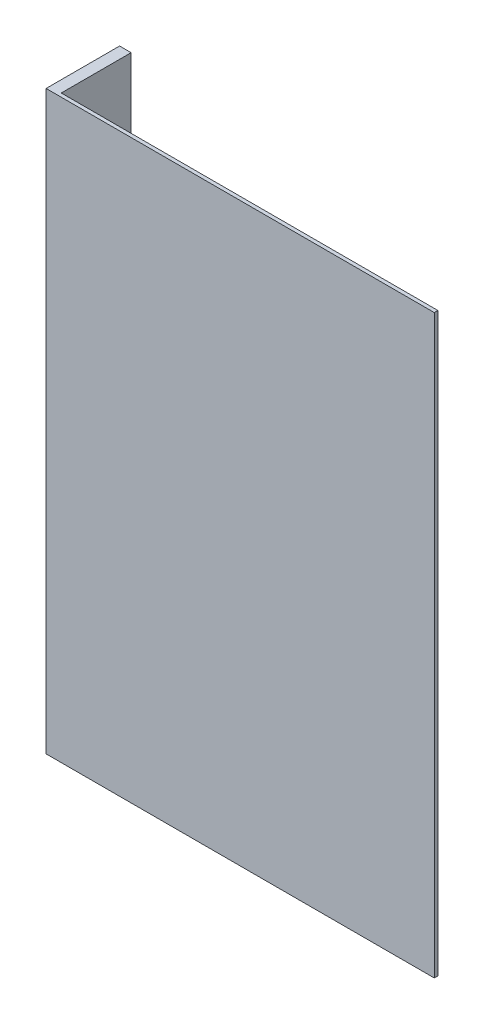
ISO-10303-21;
HEADER;
FILE_DESCRIPTION(('STEP AP214'),'2;1');
FILE_NAME('part.step','',(''),(''),'','','');
FILE_SCHEMA(('AUTOMOTIVE_DESIGN { 1 0 10303 214 1 1 1 1 }'));
ENDSEC;
DATA;
#1=APPLICATION_CONTEXT('core data for automotive mechanical design processes');
#2=APPLICATION_PROTOCOL_DEFINITION('international standard','automotive_design',2000,#1);
#3=PRODUCT_CONTEXT('',#1,'mechanical');
#4=PRODUCT('Part','Part','',(#3));
#5=PRODUCT_RELATED_PRODUCT_CATEGORY('part','',(#4));
#6=PRODUCT_DEFINITION_FORMATION('','',#4);
#7=PRODUCT_DEFINITION_CONTEXT('part definition',#1,'design');
#8=PRODUCT_DEFINITION('design','',#6,#7);
#9=PRODUCT_DEFINITION_SHAPE('','',#8);
#10=(LENGTH_UNIT() NAMED_UNIT(*) SI_UNIT(.MILLI.,.METRE.));
#11=(NAMED_UNIT(*) PLANE_ANGLE_UNIT() SI_UNIT($,.RADIAN.));
#12=(NAMED_UNIT(*) SI_UNIT($,.STERADIAN.) SOLID_ANGLE_UNIT());
#13=UNCERTAINTY_MEASURE_WITH_UNIT(LENGTH_MEASURE(1.E-05),#10,'distance_accuracy_value','');
#14=(GEOMETRIC_REPRESENTATION_CONTEXT(3) GLOBAL_UNCERTAINTY_ASSIGNED_CONTEXT((#13)) GLOBAL_UNIT_ASSIGNED_CONTEXT((#10,
#11,#12)) REPRESENTATION_CONTEXT('',''));
#15=CARTESIAN_POINT('',(0.,0.,0.));
#16=DIRECTION('',(0.,0.,1.));
#17=DIRECTION('',(1.,0.,0.));
#18=AXIS2_PLACEMENT_3D('',#15,#16,#17);
#19=CARTESIAN_POINT('',(0.,0.,0.));
#20=DIRECTION('',(0.,0.,1.));
#21=DIRECTION('',(1.,0.,0.));
#22=AXIS2_PLACEMENT_3D('',#19,#20,#21);
#23=PLANE('',#22);
#24=DIRECTION('',(0.,-1.,0.));
#25=VECTOR('',#24,1.);
#26=CARTESIAN_POINT('',(-80.4142304845409,-124.46,0.));
#27=LINE('',#26,#25);
#28=CARTESIAN_POINT('',(-80.4142304845409,2.54000000000001,0.));
#29=VERTEX_POINT('',#28);
#30=CARTESIAN_POINT('',(-80.4142304845409,-124.46,0.));
#31=VERTEX_POINT('',#30);
#32=EDGE_CURVE('E48',#29,#31,#27,.T.);
#33=ORIENTED_EDGE('',*,*,#32,.F.);
#34=DIRECTION('',(-1.,0.,0.));
#35=VECTOR('',#34,1.);
#36=CARTESIAN_POINT('',(2.59167900320902,2.54000000000001,0.));
#37=LINE('',#36,#35);
#38=CARTESIAN_POINT('',(2.59167900320902,2.54000000000001,0.));
#39=VERTEX_POINT('',#38);
#40=EDGE_CURVE('E79',#39,#29,#37,.T.);
#41=ORIENTED_EDGE('',*,*,#40,.F.);
#42=DIRECTION('',(0.,1.,0.));
#43=VECTOR('',#42,1.);
#44=CARTESIAN_POINT('',(2.59167900320902,2.54000000000001,0.));
#45=LINE('',#44,#43);
#46=CARTESIAN_POINT('',(2.59167900320902,-124.46,0.));
#47=VERTEX_POINT('',#46);
#48=EDGE_CURVE('E69',#47,#39,#45,.T.);
#49=ORIENTED_EDGE('',*,*,#48,.F.);
#50=DIRECTION('',(1.,0.,0.));
#51=VECTOR('',#50,1.);
#52=CARTESIAN_POINT('',(-72.4142304845409,-124.46,0.));
#53=LINE('',#52,#51);
#54=EDGE_CURVE('E75',#31,#47,#53,.T.);
#55=ORIENTED_EDGE('',*,*,#54,.F.);
#56=EDGE_LOOP('',(#33,#41,#49,#55));
#57=FACE_BOUND('',#56,.T.);
#58=ADVANCED_FACE('F33',(#57),#23,.F.);
#59=CARTESIAN_POINT('',(2.59167900320902,2.54000000000001,0.8));
#60=DIRECTION('',(0.,-1.,0.));
#61=DIRECTION('',(0.,0.,-1.));
#62=AXIS2_PLACEMENT_3D('',#59,#60,#61);
#63=PLANE('',#62);
#64=ORIENTED_EDGE('',*,*,#40,.T.);
#65=DIRECTION('',(0.,0.,1.));
#66=VECTOR('',#65,1.);
#67=CARTESIAN_POINT('',(-80.4142304845409,2.54000000000001,-142.425397460514));
#68=LINE('',#67,#66);
#69=CARTESIAN_POINT('',(-80.4142304845409,2.54000000000001,-15.4000000000062));
#70=VERTEX_POINT('',#69);
#71=EDGE_CURVE('E103',#70,#29,#68,.T.);
#72=ORIENTED_EDGE('',*,*,#71,.F.);
#73=DIRECTION('',(1.,0.,0.));
#74=VECTOR('',#73,1.);
#75=CARTESIAN_POINT('',(-82.9542304845492,2.54000000000001,-15.4000000000064));
#76=LINE('',#75,#74);
#77=CARTESIAN_POINT('',(-82.9542304845397,2.54000000000001,-15.4000000000064));
#78=VERTEX_POINT('',#77);
#79=EDGE_CURVE('E107',#78,#70,#76,.T.);
#80=ORIENTED_EDGE('',*,*,#79,.F.);
#81=DIRECTION('',(0.,0.,-1.));
#82=VECTOR('',#81,1.);
#83=CARTESIAN_POINT('',(-82.9542304845397,2.54000000000001,0.8));
#84=LINE('',#83,#82);
#85=CARTESIAN_POINT('',(-82.9542304845397,2.54000000000001,0.8));
#86=VERTEX_POINT('',#85);
#87=EDGE_CURVE('E82',#86,#78,#84,.T.);
#88=ORIENTED_EDGE('',*,*,#87,.F.);
#89=DIRECTION('',(-1.,0.,0.));
#90=VECTOR('',#89,1.);
#91=CARTESIAN_POINT('',(2.59167900320902,2.54000000000001,0.8));
#92=LINE('',#91,#90);
#93=CARTESIAN_POINT('',(2.59167900320902,2.54000000000001,0.8));
#94=VERTEX_POINT('',#93);
#95=EDGE_CURVE('E74',#94,#86,#92,.T.);
#96=ORIENTED_EDGE('',*,*,#95,.F.);
#97=DIRECTION('',(0.,0.,-1.));
#98=VECTOR('',#97,1.);
#99=CARTESIAN_POINT('',(2.59167900320902,2.54000000000001,0.8));
#100=LINE('',#99,#98);
#101=EDGE_CURVE('E41',#94,#39,#100,.T.);
#102=ORIENTED_EDGE('',*,*,#101,.T.);
#103=EDGE_LOOP('',(#64,#72,#80,#88,#96,#102));
#104=FACE_BOUND('',#103,.T.);
#105=ADVANCED_FACE('F35',(#104),#63,.F.);
#106=CARTESIAN_POINT('',(-72.4142304845409,-124.46,0.8));
#107=DIRECTION('',(0.,1.,0.));
#108=DIRECTION('',(0.,0.,1.));
#109=AXIS2_PLACEMENT_3D('',#106,#107,#108);
#110=PLANE('',#109);
#111=DIRECTION('',(0.,0.,-1.));
#112=VECTOR('',#111,1.);
#113=CARTESIAN_POINT('',(-82.9542304845397,-124.46,0.8));
#114=LINE('',#113,#112);
#115=CARTESIAN_POINT('',(-82.9542304845397,-124.46,0.8));
#116=VERTEX_POINT('',#115);
#117=CARTESIAN_POINT('',(-82.9542304845397,-124.46,-15.4000000000064));
#118=VERTEX_POINT('',#117);
#119=EDGE_CURVE('E86',#116,#118,#114,.T.);
#120=ORIENTED_EDGE('',*,*,#119,.T.);
#121=DIRECTION('',(-1.,0.,0.));
#122=VECTOR('',#121,1.);
#123=CARTESIAN_POINT('',(-82.9542304845492,-124.46,-15.4000000000064));
#124=LINE('',#123,#122);
#125=CARTESIAN_POINT('',(-80.4142304845409,-124.46,-15.4000000000063));
#126=VERTEX_POINT('',#125);
#127=EDGE_CURVE('E98',#126,#118,#124,.T.);
#128=ORIENTED_EDGE('',*,*,#127,.F.);
#129=DIRECTION('',(0.,0.,1.));
#130=VECTOR('',#129,1.);
#131=CARTESIAN_POINT('',(-80.4142304845409,-124.46,-142.425397460514));
#132=LINE('',#131,#130);
#133=EDGE_CURVE('E99',#126,#31,#132,.T.);
#134=ORIENTED_EDGE('',*,*,#133,.T.);
#135=ORIENTED_EDGE('',*,*,#54,.T.);
#136=DIRECTION('',(0.,0.,-1.));
#137=VECTOR('',#136,1.);
#138=CARTESIAN_POINT('',(2.59167900320902,-124.46,0.8));
#139=LINE('',#138,#137);
#140=CARTESIAN_POINT('',(2.59167900320902,-124.46,0.8));
#141=VERTEX_POINT('',#140);
#142=EDGE_CURVE('E11',#141,#47,#139,.T.);
#143=ORIENTED_EDGE('',*,*,#142,.F.);
#144=DIRECTION('',(1.,0.,0.));
#145=VECTOR('',#144,1.);
#146=CARTESIAN_POINT('',(-72.4142304845409,-124.46,0.8));
#147=LINE('',#146,#145);
#148=EDGE_CURVE('E90',#116,#141,#147,.T.);
#149=ORIENTED_EDGE('',*,*,#148,.F.);
#150=EDGE_LOOP('',(#120,#128,#134,#135,#143,#149));
#151=FACE_BOUND('',#150,.T.);
#152=ADVANCED_FACE('F134',(#151),#110,.F.);
#153=CARTESIAN_POINT('',(2.59167900320902,2.54000000000001,0.8));
#154=DIRECTION('',(-1.,0.,0.));
#155=DIRECTION('',(0.,0.,1.));
#156=AXIS2_PLACEMENT_3D('',#153,#154,#155);
#157=PLANE('',#156);
#158=ORIENTED_EDGE('',*,*,#48,.T.);
#159=ORIENTED_EDGE('',*,*,#101,.F.);
#160=DIRECTION('',(0.,1.,0.));
#161=VECTOR('',#160,1.);
#162=CARTESIAN_POINT('',(2.59167900320902,2.54000000000001,0.8));
#163=LINE('',#162,#161);
#164=EDGE_CURVE('E57',#141,#94,#163,.T.);
#165=ORIENTED_EDGE('',*,*,#164,.F.);
#166=ORIENTED_EDGE('',*,*,#142,.T.);
#167=EDGE_LOOP('',(#158,#159,#165,#166));
#168=FACE_BOUND('',#167,.T.);
#169=ADVANCED_FACE('F71',(#168),#157,.F.);
#170=CARTESIAN_POINT('',(0.,0.,0.8));
#171=DIRECTION('',(0.,0.,1.));
#172=DIRECTION('',(1.,0.,0.));
#173=AXIS2_PLACEMENT_3D('',#170,#171,#172);
#174=PLANE('',#173);
#175=ORIENTED_EDGE('',*,*,#95,.T.);
#176=DIRECTION('',(0.,-1.,0.));
#177=VECTOR('',#176,1.);
#178=CARTESIAN_POINT('',(-82.9542304845397,2.54000000000001,0.8));
#179=LINE('',#178,#177);
#180=EDGE_CURVE('E95',#86,#116,#179,.T.);
#181=ORIENTED_EDGE('',*,*,#180,.T.);
#182=ORIENTED_EDGE('',*,*,#148,.T.);
#183=ORIENTED_EDGE('',*,*,#164,.T.);
#184=EDGE_LOOP('',(#175,#181,#182,#183));
#185=FACE_BOUND('',#184,.T.);
#186=ADVANCED_FACE('F138',(#185),#174,.T.);
#187=CARTESIAN_POINT('',(-82.9542304845397,-124.46,0.8));
#188=DIRECTION('',(1.,0.,0.));
#189=DIRECTION('',(0.,0.,-1.));
#190=AXIS2_PLACEMENT_3D('',#187,#188,#189);
#191=PLANE('',#190);
#192=ORIENTED_EDGE('',*,*,#87,.T.);
#193=DIRECTION('',(0.,1.,0.));
#194=VECTOR('',#193,1.);
#195=CARTESIAN_POINT('',(-82.9542304845397,-9.46000000000002,-15.4000000000064));
#196=LINE('',#195,#194);
#197=EDGE_CURVE('E102',#118,#78,#196,.T.);
#198=ORIENTED_EDGE('',*,*,#197,.F.);
#199=ORIENTED_EDGE('',*,*,#119,.F.);
#200=ORIENTED_EDGE('',*,*,#180,.F.);
#201=EDGE_LOOP('',(#192,#198,#199,#200));
#202=FACE_BOUND('',#201,.T.);
#203=ADVANCED_FACE('F140',(#202),#191,.F.);
#204=CARTESIAN_POINT('',(-80.4142304845409,-124.46,-142.425397460514));
#205=DIRECTION('',(-1.,0.,0.));
#206=DIRECTION('',(0.,0.,1.));
#207=AXIS2_PLACEMENT_3D('',#204,#205,#206);
#208=PLANE('',#207);
#209=DIRECTION('',(0.,-1.,0.));
#210=VECTOR('',#209,1.);
#211=CARTESIAN_POINT('',(-80.4142304845409,-124.46,-15.4000000000062));
#212=LINE('',#211,#210);
#213=EDGE_CURVE('E110',#70,#126,#212,.T.);
#214=ORIENTED_EDGE('',*,*,#213,.F.);
#215=ORIENTED_EDGE('',*,*,#71,.T.);
#216=ORIENTED_EDGE('',*,*,#32,.T.);
#217=ORIENTED_EDGE('',*,*,#133,.F.);
#218=EDGE_LOOP('',(#214,#215,#216,#217));
#219=FACE_BOUND('',#218,.T.);
#220=ADVANCED_FACE('F119',(#219),#208,.F.);
#221=CARTESIAN_POINT('',(-82.9542304845397,2.54000000000001,-15.4000000000064));
#222=DIRECTION('',(0.,0.,-1.));
#223=DIRECTION('',(1.,0.,0.));
#224=AXIS2_PLACEMENT_3D('',#221,#222,#223);
#225=PLANE('',#224);
#226=ORIENTED_EDGE('',*,*,#197,.T.);
#227=ORIENTED_EDGE('',*,*,#79,.T.);
#228=ORIENTED_EDGE('',*,*,#213,.T.);
#229=ORIENTED_EDGE('',*,*,#127,.T.);
#230=EDGE_LOOP('',(#226,#227,#228,#229));
#231=FACE_BOUND('',#230,.T.);
#232=ADVANCED_FACE('F143',(#231),#225,.T.);
#233=CLOSED_SHELL('',(#58,#105,#152,#169,#186,#203,#220,#232));
#234=MANIFOLD_SOLID_BREP('B2',#233);
#235=ADVANCED_BREP_SHAPE_REPRESENTATION('',(#18,#234),#14);
#236=SHAPE_DEFINITION_REPRESENTATION(#9,#235);
ENDSEC;
END-ISO-10303-21;
